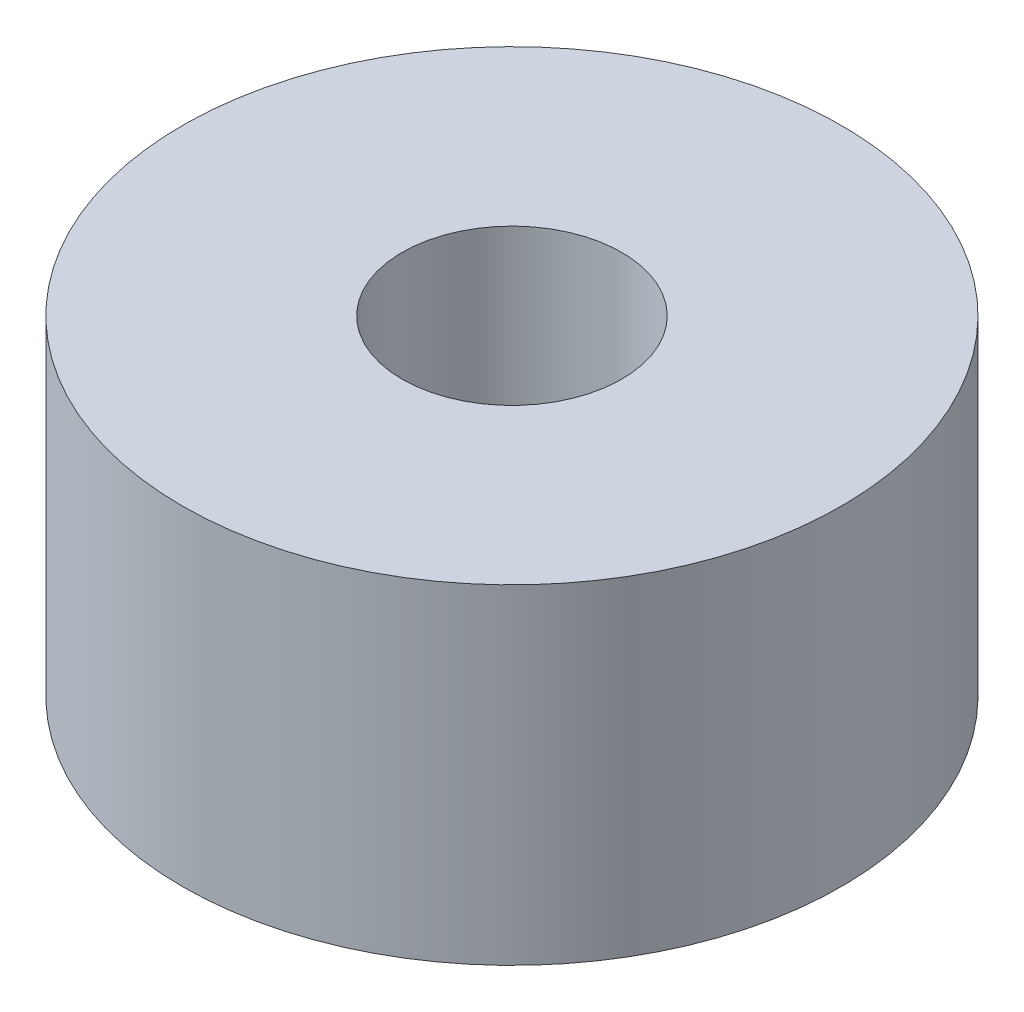
ISO-10303-21;
HEADER;
FILE_DESCRIPTION(('STEP AP214'),'2;1');
FILE_NAME('part.step','',(''),(''),'','','');
FILE_SCHEMA(('AUTOMOTIVE_DESIGN { 1 0 10303 214 1 1 1 1 }'));
ENDSEC;
DATA;
#1=APPLICATION_CONTEXT('core data for automotive mechanical design processes');
#2=APPLICATION_PROTOCOL_DEFINITION('international standard','automotive_design',2000,#1);
#3=PRODUCT_CONTEXT('',#1,'mechanical');
#4=PRODUCT('Part','Part','',(#3));
#5=PRODUCT_RELATED_PRODUCT_CATEGORY('part','',(#4));
#6=PRODUCT_DEFINITION_FORMATION('','',#4);
#7=PRODUCT_DEFINITION_CONTEXT('part definition',#1,'design');
#8=PRODUCT_DEFINITION('design','',#6,#7);
#9=PRODUCT_DEFINITION_SHAPE('','',#8);
#10=(LENGTH_UNIT() NAMED_UNIT(*) SI_UNIT(.MILLI.,.METRE.));
#11=(NAMED_UNIT(*) PLANE_ANGLE_UNIT() SI_UNIT($,.RADIAN.));
#12=(NAMED_UNIT(*) SI_UNIT($,.STERADIAN.) SOLID_ANGLE_UNIT());
#13=UNCERTAINTY_MEASURE_WITH_UNIT(LENGTH_MEASURE(1.E-05),#10,'distance_accuracy_value','');
#14=(GEOMETRIC_REPRESENTATION_CONTEXT(3) GLOBAL_UNCERTAINTY_ASSIGNED_CONTEXT((#13)) GLOBAL_UNIT_ASSIGNED_CONTEXT((#10,
#11,#12)) REPRESENTATION_CONTEXT('',''));
#15=CARTESIAN_POINT('',(0.,0.,0.));
#16=DIRECTION('',(0.,0.,1.));
#17=DIRECTION('',(1.,0.,0.));
#18=AXIS2_PLACEMENT_3D('',#15,#16,#17);
#19=CARTESIAN_POINT('',(0.,3.,0.));
#20=DIRECTION('',(0.,1.,0.));
#21=DIRECTION('',(0.,0.,1.));
#22=AXIS2_PLACEMENT_3D('',#19,#20,#21);
#23=PLANE('',#22);
#24=CARTESIAN_POINT('',(0.,3.,0.));
#25=DIRECTION('',(0.,1.,0.));
#26=DIRECTION('',(0.,0.,1.));
#27=AXIS2_PLACEMENT_3D('',#24,#25,#26);
#28=CIRCLE('',#27,3.);
#29=CARTESIAN_POINT('',(0.,3.,3.));
#30=VERTEX_POINT('',#29);
#31=EDGE_CURVE('E10',#30,#30,#28,.T.);
#32=ORIENTED_EDGE('',*,*,#31,.T.);
#33=EDGE_LOOP('',(#32));
#34=FACE_BOUND('',#33,.T.);
#35=CARTESIAN_POINT('',(0.,3.,0.));
#36=DIRECTION('',(0.,1.,0.));
#37=DIRECTION('',(0.,0.,1.));
#38=AXIS2_PLACEMENT_3D('',#35,#36,#37);
#39=CIRCLE('',#38,1.);
#40=CARTESIAN_POINT('',(0.,3.,1.));
#41=VERTEX_POINT('',#40);
#42=EDGE_CURVE('E44',#41,#41,#39,.T.);
#43=ORIENTED_EDGE('',*,*,#42,.F.);
#44=EDGE_LOOP('',(#43));
#45=FACE_BOUND('',#44,.T.);
#46=ADVANCED_FACE('F33',(#34,#45),#23,.T.);
#47=CARTESIAN_POINT('',(0.,0.,0.));
#48=DIRECTION('',(0.,1.,0.));
#49=DIRECTION('',(0.,0.,1.));
#50=AXIS2_PLACEMENT_3D('',#47,#48,#49);
#51=PLANE('',#50);
#52=CARTESIAN_POINT('',(0.,0.,0.));
#53=DIRECTION('',(0.,1.,0.));
#54=DIRECTION('',(0.,0.,1.));
#55=AXIS2_PLACEMENT_3D('',#52,#53,#54);
#56=CIRCLE('',#55,3.);
#57=CARTESIAN_POINT('',(0.,0.,3.));
#58=VERTEX_POINT('',#57);
#59=EDGE_CURVE('E37',#58,#58,#56,.T.);
#60=ORIENTED_EDGE('',*,*,#59,.F.);
#61=EDGE_LOOP('',(#60));
#62=FACE_BOUND('',#61,.T.);
#63=CARTESIAN_POINT('',(0.,0.,0.));
#64=DIRECTION('',(0.,1.,0.));
#65=DIRECTION('',(0.,0.,1.));
#66=AXIS2_PLACEMENT_3D('',#63,#64,#65);
#67=CIRCLE('',#66,1.);
#68=CARTESIAN_POINT('',(0.,0.,1.));
#69=VERTEX_POINT('',#68);
#70=EDGE_CURVE('E46',#69,#69,#67,.T.);
#71=ORIENTED_EDGE('',*,*,#70,.T.);
#72=EDGE_LOOP('',(#71));
#73=FACE_BOUND('',#72,.T.);
#74=ADVANCED_FACE('F56',(#62,#73),#51,.F.);
#75=CARTESIAN_POINT('',(0.,3.,0.));
#76=DIRECTION('',(0.,-1.,0.));
#77=DIRECTION('',(0.,0.,-1.));
#78=AXIS2_PLACEMENT_3D('',#75,#76,#77);
#79=CYLINDRICAL_SURFACE('',#78,3.);
#80=ORIENTED_EDGE('',*,*,#31,.F.);
#81=EDGE_LOOP('',(#80));
#82=FACE_BOUND('',#81,.T.);
#83=ORIENTED_EDGE('',*,*,#59,.T.);
#84=EDGE_LOOP('',(#83));
#85=FACE_BOUND('',#84,.T.);
#86=ADVANCED_FACE('F35',(#82,#85),#79,.T.);
#87=CARTESIAN_POINT('',(0.,3.,0.));
#88=DIRECTION('',(0.,-1.,0.));
#89=DIRECTION('',(0.,0.,-1.));
#90=AXIS2_PLACEMENT_3D('',#87,#88,#89);
#91=CYLINDRICAL_SURFACE('',#90,1.);
#92=ORIENTED_EDGE('',*,*,#42,.T.);
#93=EDGE_LOOP('',(#92));
#94=FACE_BOUND('',#93,.T.);
#95=ORIENTED_EDGE('',*,*,#70,.F.);
#96=EDGE_LOOP('',(#95));
#97=FACE_BOUND('',#96,.T.);
#98=ADVANCED_FACE('F52',(#94,#97),#91,.F.);
#99=CLOSED_SHELL('',(#46,#74,#86,#98));
#100=MANIFOLD_SOLID_BREP('B2',#99);
#101=ADVANCED_BREP_SHAPE_REPRESENTATION('',(#18,#100),#14);
#102=SHAPE_DEFINITION_REPRESENTATION(#9,#101);
ENDSEC;
END-ISO-10303-21;
